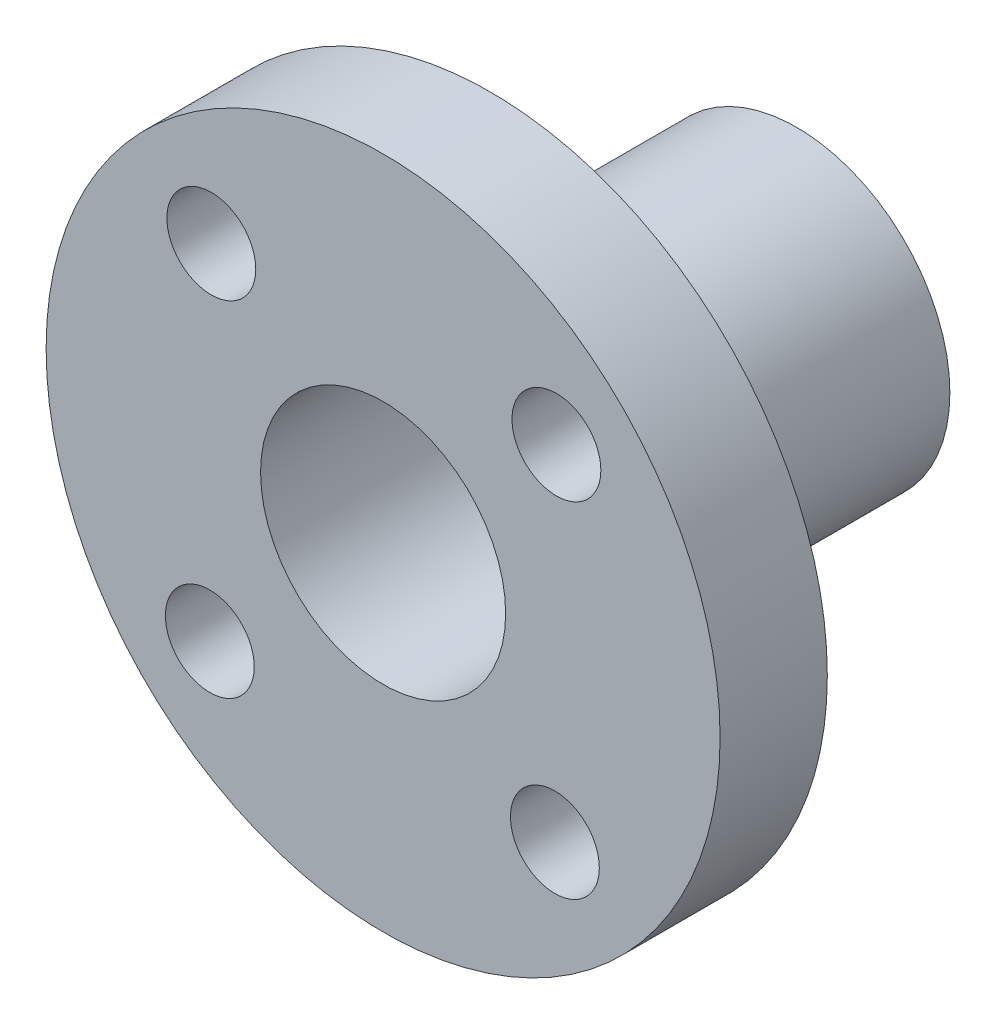
ISO-10303-21;
HEADER;
FILE_DESCRIPTION(('STEP AP214'),'2;1');
FILE_NAME('part.step','',(''),(''),'','','');
FILE_SCHEMA(('AUTOMOTIVE_DESIGN { 1 0 10303 214 1 1 1 1 }'));
ENDSEC;
DATA;
#1=APPLICATION_CONTEXT('core data for automotive mechanical design processes');
#2=APPLICATION_PROTOCOL_DEFINITION('international standard','automotive_design',2000,#1);
#3=PRODUCT_CONTEXT('',#1,'mechanical');
#4=PRODUCT('Part','Part','',(#3));
#5=PRODUCT_RELATED_PRODUCT_CATEGORY('part','',(#4));
#6=PRODUCT_DEFINITION_FORMATION('','',#4);
#7=PRODUCT_DEFINITION_CONTEXT('part definition',#1,'design');
#8=PRODUCT_DEFINITION('design','',#6,#7);
#9=PRODUCT_DEFINITION_SHAPE('','',#8);
#10=(LENGTH_UNIT() NAMED_UNIT(*) SI_UNIT(.MILLI.,.METRE.));
#11=(NAMED_UNIT(*) PLANE_ANGLE_UNIT() SI_UNIT($,.RADIAN.));
#12=(NAMED_UNIT(*) SI_UNIT($,.STERADIAN.) SOLID_ANGLE_UNIT());
#13=UNCERTAINTY_MEASURE_WITH_UNIT(LENGTH_MEASURE(1.E-05),#10,'distance_accuracy_value','');
#14=(GEOMETRIC_REPRESENTATION_CONTEXT(3) GLOBAL_UNCERTAINTY_ASSIGNED_CONTEXT((#13)) GLOBAL_UNIT_ASSIGNED_CONTEXT((#10,
#11,#12)) REPRESENTATION_CONTEXT('',''));
#15=CARTESIAN_POINT('',(0.,0.,0.));
#16=DIRECTION('',(0.,0.,1.));
#17=DIRECTION('',(1.,0.,0.));
#18=AXIS2_PLACEMENT_3D('',#15,#16,#17);
#19=CARTESIAN_POINT('',(0.,0.,0.));
#20=DIRECTION('',(0.,0.,1.));
#21=DIRECTION('',(1.,0.,0.));
#22=AXIS2_PLACEMENT_3D('',#19,#20,#21);
#23=PLANE('',#22);
#24=CARTESIAN_POINT('',(0.0499999620539732,219.949999999969,0.));
#25=DIRECTION('',(0.,0.,1.));
#26=DIRECTION('',(1.,0.,0.));
#27=AXIS2_PLACEMENT_3D('',#24,#25,#26);
#28=CIRCLE('',#27,11.);
#29=CARTESIAN_POINT('',(11.049999962054,219.949999999969,0.));
#30=VERTEX_POINT('',#29);
#31=EDGE_CURVE('E66',#30,#30,#28,.T.);
#32=ORIENTED_EDGE('',*,*,#31,.F.);
#33=EDGE_LOOP('',(#32));
#34=FACE_BOUND('',#33,.T.);
#35=CARTESIAN_POINT('',(5.65685422796516,214.293145824001,0.));
#36=DIRECTION('',(0.,0.,1.));
#37=DIRECTION('',(1.,0.,0.));
#38=AXIS2_PLACEMENT_3D('',#35,#36,#37);
#39=CIRCLE('',#38,1.45000000000023);
#40=CARTESIAN_POINT('',(7.10685422796539,214.293145824001,0.));
#41=VERTEX_POINT('',#40);
#42=EDGE_CURVE('E64',#41,#41,#39,.T.);
#43=ORIENTED_EDGE('',*,*,#42,.T.);
#44=EDGE_LOOP('',(#43));
#45=FACE_BOUND('',#44,.T.);
#46=CARTESIAN_POINT('',(-5.60685421391427,214.343145734058,0.));
#47=DIRECTION('',(0.,0.,1.));
#48=DIRECTION('',(1.,0.,0.));
#49=AXIS2_PLACEMENT_3D('',#46,#47,#48);
#50=CIRCLE('',#49,1.45000000000023);
#51=CARTESIAN_POINT('',(-4.15685421391404,214.343145734058,0.));
#52=VERTEX_POINT('',#51);
#53=EDGE_CURVE('E61',#52,#52,#50,.T.);
#54=ORIENTED_EDGE('',*,*,#53,.T.);
#55=EDGE_LOOP('',(#54));
#56=FACE_BOUND('',#55,.T.);
#57=CARTESIAN_POINT('',(-5.55685430385717,225.606854175937,0.));
#58=DIRECTION('',(0.,0.,1.));
#59=DIRECTION('',(1.,0.,0.));
#60=AXIS2_PLACEMENT_3D('',#57,#58,#59);
#61=CIRCLE('',#60,1.45000000000023);
#62=CARTESIAN_POINT('',(-4.10685430385695,225.606854175937,0.));
#63=VERTEX_POINT('',#62);
#64=EDGE_CURVE('E57',#63,#63,#61,.T.);
#65=ORIENTED_EDGE('',*,*,#64,.T.);
#66=EDGE_LOOP('',(#65));
#67=FACE_BOUND('',#66,.T.);
#68=CARTESIAN_POINT('',(5.70685413802219,225.55685426588,0.));
#69=DIRECTION('',(0.,0.,1.));
#70=DIRECTION('',(1.,0.,0.));
#71=AXIS2_PLACEMENT_3D('',#68,#69,#70);
#72=CIRCLE('',#71,1.45000000000022);
#73=CARTESIAN_POINT('',(7.15685413802241,225.55685426588,0.));
#74=VERTEX_POINT('',#73);
#75=EDGE_CURVE('E54',#74,#74,#72,.T.);
#76=ORIENTED_EDGE('',*,*,#75,.T.);
#77=EDGE_LOOP('',(#76));
#78=FACE_BOUND('',#77,.T.);
#79=CARTESIAN_POINT('',(0.0499999620539743,219.949999999969,0.));
#80=DIRECTION('',(0.,0.,1.));
#81=DIRECTION('',(1.,0.,0.));
#82=AXIS2_PLACEMENT_3D('',#79,#80,#81);
#83=CIRCLE('',#82,5.);
#84=CARTESIAN_POINT('',(5.04999996205398,219.949999999969,0.));
#85=VERTEX_POINT('',#84);
#86=EDGE_CURVE('E10',#85,#85,#83,.F.);
#87=ORIENTED_EDGE('',*,*,#86,.F.);
#88=EDGE_LOOP('',(#87));
#89=FACE_BOUND('',#88,.T.);
#90=ADVANCED_FACE('F34',(#34,#45,#56,#67,#78,#89),#23,.F.);
#91=CARTESIAN_POINT('',(0.0499999620539732,219.949999999969,3.5));
#92=DIRECTION('',(0.,0.,-1.));
#93=DIRECTION('',(-1.,0.,0.));
#94=AXIS2_PLACEMENT_3D('',#91,#92,#93);
#95=CYLINDRICAL_SURFACE('',#94,4.);
#96=CARTESIAN_POINT('',(0.0499999620539732,219.949999999969,3.5));
#97=DIRECTION('',(0.,0.,1.));
#98=DIRECTION('',(1.,0.,0.));
#99=AXIS2_PLACEMENT_3D('',#96,#97,#98);
#100=CIRCLE('',#99,4.);
#101=CARTESIAN_POINT('',(4.04999996205397,219.949999999969,3.5));
#102=VERTEX_POINT('',#101);
#103=EDGE_CURVE('E45',#102,#102,#100,.T.);
#104=ORIENTED_EDGE('',*,*,#103,.T.);
#105=EDGE_LOOP('',(#104));
#106=FACE_BOUND('',#105,.T.);
#107=CARTESIAN_POINT('',(0.0499999620539743,219.949999999969,-10.));
#108=DIRECTION('',(0.,0.,-1.));
#109=DIRECTION('',(-1.,0.,0.));
#110=AXIS2_PLACEMENT_3D('',#107,#108,#109);
#111=CIRCLE('',#110,4.);
#112=CARTESIAN_POINT('',(-3.95000003794603,219.949999999969,-10.));
#113=VERTEX_POINT('',#112);
#114=EDGE_CURVE('E104',#113,#113,#111,.T.);
#115=ORIENTED_EDGE('',*,*,#114,.T.);
#116=EDGE_LOOP('',(#115));
#117=FACE_BOUND('',#116,.T.);
#118=ADVANCED_FACE('F98',(#106,#117),#95,.F.);
#119=CARTESIAN_POINT('',(5.65685422796516,214.293145824001,3.5));
#120=DIRECTION('',(0.,0.,-1.));
#121=DIRECTION('',(-1.,0.,0.));
#122=AXIS2_PLACEMENT_3D('',#119,#120,#121);
#123=CYLINDRICAL_SURFACE('',#122,1.45000000000023);
#124=CARTESIAN_POINT('',(5.65685422796516,214.293145824001,3.5));
#125=DIRECTION('',(0.,0.,1.));
#126=DIRECTION('',(1.,0.,0.));
#127=AXIS2_PLACEMENT_3D('',#124,#125,#126);
#128=CIRCLE('',#127,1.45000000000023);
#129=CARTESIAN_POINT('',(7.10685422796539,214.293145824001,3.5));
#130=VERTEX_POINT('',#129);
#131=EDGE_CURVE('E50',#130,#130,#128,.T.);
#132=ORIENTED_EDGE('',*,*,#131,.T.);
#133=EDGE_LOOP('',(#132));
#134=FACE_BOUND('',#133,.T.);
#135=ORIENTED_EDGE('',*,*,#42,.F.);
#136=EDGE_LOOP('',(#135));
#137=FACE_BOUND('',#136,.T.);
#138=ADVANCED_FACE('F86',(#134,#137),#123,.F.);
#139=CARTESIAN_POINT('',(-5.60685421391427,214.343145734058,3.5));
#140=DIRECTION('',(0.,0.,-1.));
#141=DIRECTION('',(-1.,0.,0.));
#142=AXIS2_PLACEMENT_3D('',#139,#140,#141);
#143=CYLINDRICAL_SURFACE('',#142,1.45000000000023);
#144=CARTESIAN_POINT('',(-5.60685421391427,214.343145734058,3.5));
#145=DIRECTION('',(0.,0.,1.));
#146=DIRECTION('',(1.,0.,0.));
#147=AXIS2_PLACEMENT_3D('',#144,#145,#146);
#148=CIRCLE('',#147,1.45000000000023);
#149=CARTESIAN_POINT('',(-4.15685421391404,214.343145734058,3.5));
#150=VERTEX_POINT('',#149);
#151=EDGE_CURVE('E77',#150,#150,#148,.T.);
#152=ORIENTED_EDGE('',*,*,#151,.T.);
#153=EDGE_LOOP('',(#152));
#154=FACE_BOUND('',#153,.T.);
#155=ORIENTED_EDGE('',*,*,#53,.F.);
#156=EDGE_LOOP('',(#155));
#157=FACE_BOUND('',#156,.T.);
#158=ADVANCED_FACE('F129',(#154,#157),#143,.F.);
#159=CARTESIAN_POINT('',(-5.55685430385717,225.606854175937,3.5));
#160=DIRECTION('',(0.,0.,-1.));
#161=DIRECTION('',(-1.,0.,0.));
#162=AXIS2_PLACEMENT_3D('',#159,#160,#161);
#163=CYLINDRICAL_SURFACE('',#162,1.45000000000023);
#164=CARTESIAN_POINT('',(-5.55685430385717,225.606854175937,3.5));
#165=DIRECTION('',(0.,0.,1.));
#166=DIRECTION('',(1.,0.,0.));
#167=AXIS2_PLACEMENT_3D('',#164,#165,#166);
#168=CIRCLE('',#167,1.45000000000023);
#169=CARTESIAN_POINT('',(-4.10685430385695,225.606854175937,3.5));
#170=VERTEX_POINT('',#169);
#171=EDGE_CURVE('E72',#170,#170,#168,.T.);
#172=ORIENTED_EDGE('',*,*,#171,.T.);
#173=EDGE_LOOP('',(#172));
#174=FACE_BOUND('',#173,.T.);
#175=ORIENTED_EDGE('',*,*,#64,.F.);
#176=EDGE_LOOP('',(#175));
#177=FACE_BOUND('',#176,.T.);
#178=ADVANCED_FACE('F131',(#174,#177),#163,.F.);
#179=CARTESIAN_POINT('',(5.70685413802219,225.55685426588,3.5));
#180=DIRECTION('',(0.,0.,-1.));
#181=DIRECTION('',(-1.,0.,0.));
#182=AXIS2_PLACEMENT_3D('',#179,#180,#181);
#183=CYLINDRICAL_SURFACE('',#182,1.45000000000022);
#184=CARTESIAN_POINT('',(5.70685413802219,225.55685426588,3.5));
#185=DIRECTION('',(0.,0.,1.));
#186=DIRECTION('',(1.,0.,0.));
#187=AXIS2_PLACEMENT_3D('',#184,#185,#186);
#188=CIRCLE('',#187,1.45000000000022);
#189=CARTESIAN_POINT('',(7.15685413802241,225.55685426588,3.5));
#190=VERTEX_POINT('',#189);
#191=EDGE_CURVE('E68',#190,#190,#188,.T.);
#192=ORIENTED_EDGE('',*,*,#191,.T.);
#193=EDGE_LOOP('',(#192));
#194=FACE_BOUND('',#193,.T.);
#195=ORIENTED_EDGE('',*,*,#75,.F.);
#196=EDGE_LOOP('',(#195));
#197=FACE_BOUND('',#196,.T.);
#198=ADVANCED_FACE('F36',(#194,#197),#183,.F.);
#199=CARTESIAN_POINT('',(0.0499999620539732,219.949999999969,3.5));
#200=DIRECTION('',(0.,0.,-1.));
#201=DIRECTION('',(-1.,0.,0.));
#202=AXIS2_PLACEMENT_3D('',#199,#200,#201);
#203=CYLINDRICAL_SURFACE('',#202,11.);
#204=CARTESIAN_POINT('',(0.0499999620539732,219.949999999969,3.5));
#205=DIRECTION('',(0.,0.,1.));
#206=DIRECTION('',(1.,0.,0.));
#207=AXIS2_PLACEMENT_3D('',#204,#205,#206);
#208=CIRCLE('',#207,11.);
#209=CARTESIAN_POINT('',(11.049999962054,219.949999999969,3.5));
#210=VERTEX_POINT('',#209);
#211=EDGE_CURVE('E41',#210,#210,#208,.T.);
#212=ORIENTED_EDGE('',*,*,#211,.F.);
#213=EDGE_LOOP('',(#212));
#214=FACE_BOUND('',#213,.T.);
#215=ORIENTED_EDGE('',*,*,#31,.T.);
#216=EDGE_LOOP('',(#215));
#217=FACE_BOUND('',#216,.T.);
#218=ADVANCED_FACE('F93',(#214,#217),#203,.T.);
#219=CARTESIAN_POINT('',(0.,0.,3.5));
#220=DIRECTION('',(0.,0.,1.));
#221=DIRECTION('',(1.,0.,0.));
#222=AXIS2_PLACEMENT_3D('',#219,#220,#221);
#223=PLANE('',#222);
#224=ORIENTED_EDGE('',*,*,#191,.F.);
#225=EDGE_LOOP('',(#224));
#226=FACE_BOUND('',#225,.T.);
#227=ORIENTED_EDGE('',*,*,#171,.F.);
#228=EDGE_LOOP('',(#227));
#229=FACE_BOUND('',#228,.T.);
#230=ORIENTED_EDGE('',*,*,#151,.F.);
#231=EDGE_LOOP('',(#230));
#232=FACE_BOUND('',#231,.T.);
#233=ORIENTED_EDGE('',*,*,#131,.F.);
#234=EDGE_LOOP('',(#233));
#235=FACE_BOUND('',#234,.T.);
#236=ORIENTED_EDGE('',*,*,#103,.F.);
#237=EDGE_LOOP('',(#236));
#238=FACE_BOUND('',#237,.T.);
#239=ORIENTED_EDGE('',*,*,#211,.T.);
#240=EDGE_LOOP('',(#239));
#241=FACE_BOUND('',#240,.T.);
#242=ADVANCED_FACE('F89',(#226,#229,#232,#235,#238,#241),#223,.T.);
#243=CARTESIAN_POINT('',(0.0499999620539743,219.949999999969,-10.));
#244=DIRECTION('',(0.,0.,-1.));
#245=DIRECTION('',(-1.,0.,0.));
#246=AXIS2_PLACEMENT_3D('',#243,#244,#245);
#247=PLANE('',#246);
#248=CARTESIAN_POINT('',(0.0499999620539743,219.949999999969,-10.));
#249=DIRECTION('',(0.,0.,-1.));
#250=DIRECTION('',(-1.,0.,0.));
#251=AXIS2_PLACEMENT_3D('',#248,#249,#250);
#252=CIRCLE('',#251,5.);
#253=CARTESIAN_POINT('',(-4.95000003794603,219.949999999969,-10.));
#254=VERTEX_POINT('',#253);
#255=EDGE_CURVE('E58',#254,#254,#252,.T.);
#256=ORIENTED_EDGE('',*,*,#255,.T.);
#257=EDGE_LOOP('',(#256));
#258=FACE_BOUND('',#257,.T.);
#259=ORIENTED_EDGE('',*,*,#114,.F.);
#260=EDGE_LOOP('',(#259));
#261=FACE_BOUND('',#260,.T.);
#262=ADVANCED_FACE('F92',(#258,#261),#247,.T.);
#263=CARTESIAN_POINT('',(0.0499999620539743,219.949999999969,-10.));
#264=DIRECTION('',(0.,0.,1.));
#265=DIRECTION('',(1.,0.,0.));
#266=AXIS2_PLACEMENT_3D('',#263,#264,#265);
#267=CYLINDRICAL_SURFACE('',#266,5.);
#268=ORIENTED_EDGE('',*,*,#255,.F.);
#269=EDGE_LOOP('',(#268));
#270=FACE_BOUND('',#269,.T.);
#271=ORIENTED_EDGE('',*,*,#86,.T.);
#272=EDGE_LOOP('',(#271));
#273=FACE_BOUND('',#272,.T.);
#274=ADVANCED_FACE('F110',(#270,#273),#267,.T.);
#275=CLOSED_SHELL('',(#90,#118,#138,#158,#178,#198,#218,#242,#262,#274));
#276=MANIFOLD_SOLID_BREP('B2',#275);
#277=ADVANCED_BREP_SHAPE_REPRESENTATION('',(#18,#276),#14);
#278=SHAPE_DEFINITION_REPRESENTATION(#9,#277);
ENDSEC;
END-ISO-10303-21;
